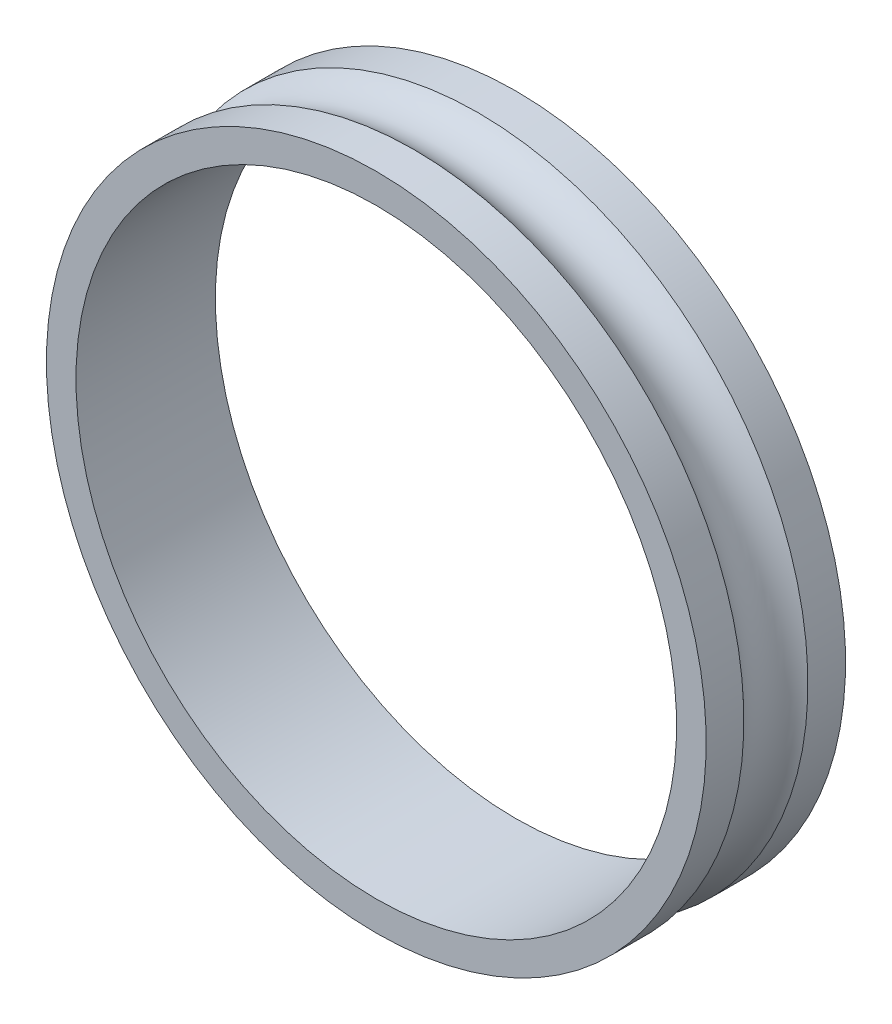
ISO-10303-21;
HEADER;
FILE_DESCRIPTION(('STEP AP214'),'2;1');
FILE_NAME('part.step','',(''),(''),'','','');
FILE_SCHEMA(('AUTOMOTIVE_DESIGN { 1 0 10303 214 1 1 1 1 }'));
ENDSEC;
DATA;
#1=APPLICATION_CONTEXT('core data for automotive mechanical design processes');
#2=APPLICATION_PROTOCOL_DEFINITION('international standard','automotive_design',2000,#1);
#3=PRODUCT_CONTEXT('',#1,'mechanical');
#4=PRODUCT('Part','Part','',(#3));
#5=PRODUCT_RELATED_PRODUCT_CATEGORY('part','',(#4));
#6=PRODUCT_DEFINITION_FORMATION('','',#4);
#7=PRODUCT_DEFINITION_CONTEXT('part definition',#1,'design');
#8=PRODUCT_DEFINITION('design','',#6,#7);
#9=PRODUCT_DEFINITION_SHAPE('','',#8);
#10=(LENGTH_UNIT() NAMED_UNIT(*) SI_UNIT(.MILLI.,.METRE.));
#11=(NAMED_UNIT(*) PLANE_ANGLE_UNIT() SI_UNIT($,.RADIAN.));
#12=(NAMED_UNIT(*) SI_UNIT($,.STERADIAN.) SOLID_ANGLE_UNIT());
#13=UNCERTAINTY_MEASURE_WITH_UNIT(LENGTH_MEASURE(1.E-05),#10,'distance_accuracy_value','');
#14=(GEOMETRIC_REPRESENTATION_CONTEXT(3) GLOBAL_UNCERTAINTY_ASSIGNED_CONTEXT((#13)) GLOBAL_UNIT_ASSIGNED_CONTEXT((#10,
#11,#12)) REPRESENTATION_CONTEXT('',''));
#15=CARTESIAN_POINT('',(0.,0.,0.));
#16=DIRECTION('',(0.,0.,1.));
#17=DIRECTION('',(1.,0.,0.));
#18=AXIS2_PLACEMENT_3D('',#15,#16,#17);
#19=CARTESIAN_POINT('',(7.81,0.,3.30000000003789));
#20=DIRECTION('',(0.,0.,-1.));
#21=DIRECTION('',(0.,-1.,0.));
#22=AXIS2_PLACEMENT_3D('',#19,#20,#21);
#23=PLANE('',#22);
#24=CARTESIAN_POINT('',(0.,0.,3.30000000003789));
#25=DIRECTION('',(0.,0.,1.));
#26=DIRECTION('',(0.,-1.,0.));
#27=AXIS2_PLACEMENT_3D('',#24,#25,#26);
#28=CIRCLE('',#27,7.11);
#29=CARTESIAN_POINT('',(0.,-7.11,3.30000000003789));
#30=VERTEX_POINT('',#29);
#31=EDGE_CURVE('E11',#30,#30,#28,.T.);
#32=ORIENTED_EDGE('',*,*,#31,.T.);
#33=EDGE_LOOP('',(#32));
#34=FACE_BOUND('',#33,.T.);
#35=CARTESIAN_POINT('',(0.,0.,3.30000000003789));
#36=DIRECTION('',(0.,0.,1.));
#37=DIRECTION('',(0.,-1.,0.));
#38=AXIS2_PLACEMENT_3D('',#35,#36,#37);
#39=CIRCLE('',#38,7.81);
#40=CARTESIAN_POINT('',(0.,-7.81,3.30000000003789));
#41=VERTEX_POINT('',#40);
#42=EDGE_CURVE('E52',#41,#41,#39,.T.);
#43=ORIENTED_EDGE('',*,*,#42,.F.);
#44=EDGE_LOOP('',(#43));
#45=FACE_BOUND('',#44,.T.);
#46=ADVANCED_FACE('F17',(#34,#45),#23,.T.);
#47=CARTESIAN_POINT('',(0.,0.,3.30000000003789));
#48=DIRECTION('',(0.,0.,1.));
#49=DIRECTION('',(0.,1.,0.));
#50=AXIS2_PLACEMENT_3D('',#47,#48,#49);
#51=CYLINDRICAL_SURFACE('',#50,7.11);
#52=CARTESIAN_POINT('',(0.,0.,6.60000000003789));
#53=DIRECTION('',(0.,0.,1.));
#54=DIRECTION('',(0.,-1.,0.));
#55=AXIS2_PLACEMENT_3D('',#52,#53,#54);
#56=CIRCLE('',#55,7.11);
#57=CARTESIAN_POINT('',(0.,-7.11,6.60000000003789));
#58=VERTEX_POINT('',#57);
#59=EDGE_CURVE('E28',#58,#58,#56,.T.);
#60=ORIENTED_EDGE('',*,*,#59,.T.);
#61=EDGE_LOOP('',(#60));
#62=FACE_BOUND('',#61,.T.);
#63=ORIENTED_EDGE('',*,*,#31,.F.);
#64=EDGE_LOOP('',(#63));
#65=FACE_BOUND('',#64,.T.);
#66=ADVANCED_FACE('F82',(#62,#65),#51,.F.);
#67=CARTESIAN_POINT('',(7.11,0.,6.60000000003789));
#68=DIRECTION('',(0.,0.,1.));
#69=DIRECTION('',(0.,1.,0.));
#70=AXIS2_PLACEMENT_3D('',#67,#68,#69);
#71=PLANE('',#70);
#72=CARTESIAN_POINT('',(0.,0.,6.60000000003789));
#73=DIRECTION('',(0.,0.,1.));
#74=DIRECTION('',(0.,-1.,0.));
#75=AXIS2_PLACEMENT_3D('',#72,#73,#74);
#76=CIRCLE('',#75,7.81);
#77=CARTESIAN_POINT('',(0.,-7.81,6.60000000003789));
#78=VERTEX_POINT('',#77);
#79=EDGE_CURVE('E58',#78,#78,#76,.T.);
#80=ORIENTED_EDGE('',*,*,#79,.T.);
#81=EDGE_LOOP('',(#80));
#82=FACE_BOUND('',#81,.T.);
#83=ORIENTED_EDGE('',*,*,#59,.F.);
#84=EDGE_LOOP('',(#83));
#85=FACE_BOUND('',#84,.T.);
#86=ADVANCED_FACE('F70',(#82,#85),#71,.T.);
#87=CARTESIAN_POINT('',(0.,0.,3.30000000003789));
#88=DIRECTION('',(0.,0.,1.));
#89=DIRECTION('',(0.,1.,0.));
#90=AXIS2_PLACEMENT_3D('',#87,#88,#89);
#91=CYLINDRICAL_SURFACE('',#90,7.81000000000123);
#92=CARTESIAN_POINT('',(0.,0.,5.70778872389385));
#93=DIRECTION('',(0.,0.,1.));
#94=DIRECTION('',(0.,-1.,0.));
#95=AXIS2_PLACEMENT_3D('',#92,#93,#94);
#96=CIRCLE('',#95,7.81000000000248);
#97=CARTESIAN_POINT('',(0.,-7.81000000000248,5.70778872389385));
#98=VERTEX_POINT('',#97);
#99=EDGE_CURVE('E46',#98,#98,#96,.T.);
#100=ORIENTED_EDGE('',*,*,#99,.T.);
#101=EDGE_LOOP('',(#100));
#102=FACE_BOUND('',#101,.T.);
#103=ORIENTED_EDGE('',*,*,#79,.F.);
#104=EDGE_LOOP('',(#103));
#105=FACE_BOUND('',#104,.T.);
#106=ADVANCED_FACE('F73',(#102,#105),#91,.T.);
#107=CARTESIAN_POINT('',(0.,0.,4.95000000003789));
#108=DIRECTION('',(0.,0.,1.));
#109=DIRECTION('',(0.,1.,0.));
#110=AXIS2_PLACEMENT_3D('',#107,#108,#109);
#111=TOROIDAL_SURFACE('',#110,8.4625,1.);
#112=CARTESIAN_POINT('',(0.,0.,4.19221127618543));
#113=DIRECTION('',(0.,0.,1.));
#114=DIRECTION('',(0.,-1.,0.));
#115=AXIS2_PLACEMENT_3D('',#112,#113,#114);
#116=CIRCLE('',#115,7.80999999999842);
#117=CARTESIAN_POINT('',(0.,-7.80999999999842,4.19221127618543));
#118=VERTEX_POINT('',#117);
#119=EDGE_CURVE('E21',#118,#118,#116,.T.);
#120=ORIENTED_EDGE('',*,*,#119,.T.);
#121=EDGE_LOOP('',(#120));
#122=FACE_BOUND('',#121,.T.);
#123=ORIENTED_EDGE('',*,*,#99,.F.);
#124=EDGE_LOOP('',(#123));
#125=FACE_BOUND('',#124,.T.);
#126=ADVANCED_FACE('F75',(#122,#125),#111,.F.);
#127=CARTESIAN_POINT('',(0.,0.,3.30000000003789));
#128=DIRECTION('',(0.,0.,1.));
#129=DIRECTION('',(0.,1.,0.));
#130=AXIS2_PLACEMENT_3D('',#127,#128,#129);
#131=CYLINDRICAL_SURFACE('',#130,7.80999999999921);
#132=ORIENTED_EDGE('',*,*,#42,.T.);
#133=EDGE_LOOP('',(#132));
#134=FACE_BOUND('',#133,.T.);
#135=ORIENTED_EDGE('',*,*,#119,.F.);
#136=EDGE_LOOP('',(#135));
#137=FACE_BOUND('',#136,.T.);
#138=ADVANCED_FACE('F19',(#134,#137),#131,.T.);
#139=CLOSED_SHELL('',(#46,#66,#86,#106,#126,#138));
#140=MANIFOLD_SOLID_BREP('B1',#139);
#141=ADVANCED_BREP_SHAPE_REPRESENTATION('',(#18,#140),#14);
#142=SHAPE_DEFINITION_REPRESENTATION(#9,#141);
ENDSEC;
END-ISO-10303-21;
